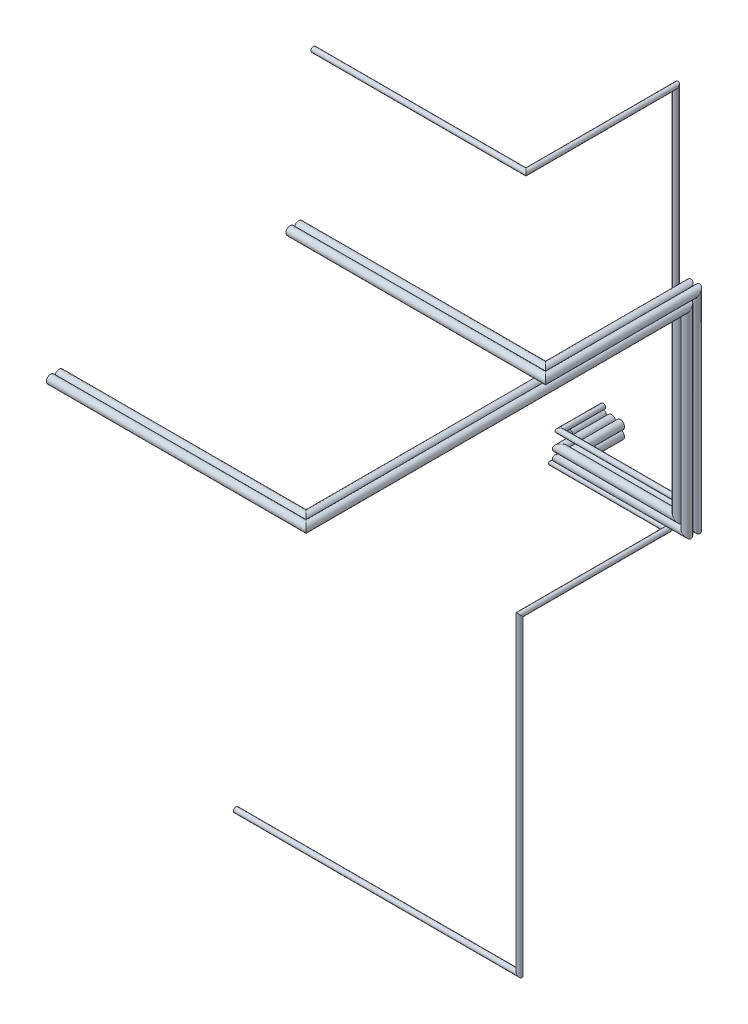
ISO-10303-21;
HEADER;
FILE_DESCRIPTION(('STEP AP214'),'2;1');
FILE_NAME('part.step','',(''),(''),'','','');
FILE_SCHEMA(('AUTOMOTIVE_DESIGN { 1 0 10303 214 1 1 1 1 }'));
ENDSEC;
DATA;
#1=APPLICATION_CONTEXT('core data for automotive mechanical design processes');
#2=APPLICATION_PROTOCOL_DEFINITION('international standard','automotive_design',2000,#1);
#3=PRODUCT_CONTEXT('',#1,'mechanical');
#4=PRODUCT('Part','Part','',(#3));
#5=PRODUCT_RELATED_PRODUCT_CATEGORY('part','',(#4));
#6=PRODUCT_DEFINITION_FORMATION('','',#4);
#7=PRODUCT_DEFINITION_CONTEXT('part definition',#1,'design');
#8=PRODUCT_DEFINITION('design','',#6,#7);
#9=PRODUCT_DEFINITION_SHAPE('','',#8);
#10=(LENGTH_UNIT() NAMED_UNIT(*) SI_UNIT(.MILLI.,.METRE.));
#11=(NAMED_UNIT(*) PLANE_ANGLE_UNIT() SI_UNIT($,.RADIAN.));
#12=(NAMED_UNIT(*) SI_UNIT($,.STERADIAN.) SOLID_ANGLE_UNIT());
#13=UNCERTAINTY_MEASURE_WITH_UNIT(LENGTH_MEASURE(1.E-05),#10,'distance_accuracy_value','');
#14=(GEOMETRIC_REPRESENTATION_CONTEXT(3) GLOBAL_UNCERTAINTY_ASSIGNED_CONTEXT((#13)) GLOBAL_UNIT_ASSIGNED_CONTEXT((#10,
#11,#12)) REPRESENTATION_CONTEXT('',''));
#15=CARTESIAN_POINT('',(0.,0.,0.));
#16=DIRECTION('',(0.,0.,1.));
#17=DIRECTION('',(1.,0.,0.));
#18=AXIS2_PLACEMENT_3D('',#15,#16,#17);
#19=CARTESIAN_POINT('',(-99.2922099597104,-103.996357315317,400.));
#20=DIRECTION('',(0.,0.,-1.));
#21=DIRECTION('',(-1.,0.,0.));
#22=AXIS2_PLACEMENT_3D('',#19,#20,#21);
#23=CYLINDRICAL_SURFACE('',#22,30.);
#24=CARTESIAN_POINT('',(-99.2922099597104,-103.996357315317,0.));
#25=DIRECTION('',(0.,0.,-1.));
#26=DIRECTION('',(-1.,0.,0.));
#27=AXIS2_PLACEMENT_3D('',#24,#25,#26);
#28=CIRCLE('',#27,30.);
#29=CARTESIAN_POINT('',(-129.29220995971,-103.996357315317,0.));
#30=VERTEX_POINT('',#29);
#31=EDGE_CURVE('E12',#30,#30,#28,.T.);
#32=ORIENTED_EDGE('',*,*,#31,.F.);
#33=EDGE_LOOP('',(#32));
#34=FACE_BOUND('',#33,.T.);
#35=CARTESIAN_POINT('',(-99.2922099597104,-103.996357315317,587.653269416734));
#36=DIRECTION('',(0.707106781186548,0.,0.707106781186547));
#37=DIRECTION('',(0.707106781186547,0.,-0.707106781186548));
#38=AXIS2_PLACEMENT_3D('',#35,#36,#37);
#39=ELLIPSE('',#38,42.4264068711929,30.);
#40=CARTESIAN_POINT('',(-69.2922099597104,-103.996357315317,557.653269416734));
#41=VERTEX_POINT('',#40);
#42=EDGE_CURVE('E87',#41,#41,#39,.T.);
#43=ORIENTED_EDGE('',*,*,#42,.F.);
#44=EDGE_LOOP('',(#43));
#45=FACE_BOUND('',#44,.T.);
#46=ADVANCED_FACE('F65',(#34,#45),#23,.T.);
#47=CARTESIAN_POINT('',(-99.2922099597104,-103.996357315317,0.));
#48=DIRECTION('',(0.,0.,-1.));
#49=DIRECTION('',(-1.,0.,0.));
#50=AXIS2_PLACEMENT_3D('',#47,#48,#49);
#51=PLANE('',#50);
#52=ORIENTED_EDGE('',*,*,#31,.T.);
#53=EDGE_LOOP('',(#52));
#54=FACE_BOUND('',#53,.T.);
#55=ADVANCED_FACE('F95',(#54),#51,.T.);
#56=CARTESIAN_POINT('',(1250.70779004029,-3775.40455596034,2337.65326941673));
#57=DIRECTION('',(-1.,0.,0.));
#58=DIRECTION('',(0.,0.,1.));
#59=AXIS2_PLACEMENT_3D('',#56,#57,#58);
#60=CYLINDRICAL_SURFACE('',#59,30.);
#61=CARTESIAN_POINT('',(1250.70779004029,-3775.40455596034,2337.65326941673));
#62=DIRECTION('',(-0.707106781186547,-0.707106781186548,0.));
#63=DIRECTION('',(0.707106781186548,-0.707106781186547,0.));
#64=AXIS2_PLACEMENT_3D('',#61,#62,#63);
#65=ELLIPSE('',#64,42.4264068711929,30.);
#66=CARTESIAN_POINT('',(1280.70779004029,-3805.40455596034,2337.65326941673));
#67=VERTEX_POINT('',#66);
#68=EDGE_CURVE('E75',#67,#67,#65,.F.);
#69=ORIENTED_EDGE('',*,*,#68,.F.);
#70=EDGE_LOOP('',(#69));
#71=FACE_BOUND('',#70,.T.);
#72=CARTESIAN_POINT('',(-2100.96796055242,-3775.40455596034,2337.65326941673));
#73=DIRECTION('',(-1.,0.,0.));
#74=DIRECTION('',(0.,0.,1.));
#75=AXIS2_PLACEMENT_3D('',#72,#73,#74);
#76=CIRCLE('',#75,30.);
#77=CARTESIAN_POINT('',(-2100.96796055242,-3775.40455596034,2367.65326941673));
#78=VERTEX_POINT('',#77);
#79=EDGE_CURVE('E71',#78,#78,#76,.T.);
#80=ORIENTED_EDGE('',*,*,#79,.F.);
#81=EDGE_LOOP('',(#80));
#82=FACE_BOUND('',#81,.T.);
#83=ADVANCED_FACE('F100',(#71,#82),#60,.T.);
#84=CARTESIAN_POINT('',(1250.70779004029,-103.996357315317,2337.65326941673));
#85=DIRECTION('',(0.,-1.,0.));
#86=DIRECTION('',(0.,0.,-1.));
#87=AXIS2_PLACEMENT_3D('',#84,#85,#86);
#88=CYLINDRICAL_SURFACE('',#87,30.);
#89=CARTESIAN_POINT('',(1250.70779004029,-103.996357315317,2337.65326941673));
#90=DIRECTION('',(0.,-0.707106781186548,0.707106781186547));
#91=DIRECTION('',(0.,0.707106781186547,0.707106781186548));
#92=AXIS2_PLACEMENT_3D('',#89,#90,#91);
#93=ELLIPSE('',#92,42.4264068711929,30.);
#94=CARTESIAN_POINT('',(1250.70779004029,-73.9963573153173,2367.65326941673));
#95=VERTEX_POINT('',#94);
#96=EDGE_CURVE('E79',#95,#95,#93,.T.);
#97=ORIENTED_EDGE('',*,*,#96,.T.);
#98=EDGE_LOOP('',(#97));
#99=FACE_BOUND('',#98,.T.);
#100=ORIENTED_EDGE('',*,*,#68,.T.);
#101=EDGE_LOOP('',(#100));
#102=FACE_BOUND('',#101,.T.);
#103=ADVANCED_FACE('F104',(#99,#102),#88,.T.);
#104=CARTESIAN_POINT('',(1250.70779004029,-103.996357315317,587.653269416733));
#105=DIRECTION('',(0.,0.,1.));
#106=DIRECTION('',(1.,0.,0.));
#107=AXIS2_PLACEMENT_3D('',#104,#105,#106);
#108=CYLINDRICAL_SURFACE('',#107,30.);
#109=CARTESIAN_POINT('',(1250.70779004029,-103.996357315317,587.653269416733));
#110=DIRECTION('',(0.707106781186548,0.,0.707106781186548));
#111=DIRECTION('',(0.707106781186548,0.,-0.707106781186548));
#112=AXIS2_PLACEMENT_3D('',#109,#110,#111);
#113=ELLIPSE('',#112,42.4264068711929,30.);
#114=CARTESIAN_POINT('',(1280.70779004029,-103.996357315317,557.653269416733));
#115=VERTEX_POINT('',#114);
#116=EDGE_CURVE('E84',#115,#115,#113,.F.);
#117=ORIENTED_EDGE('',*,*,#116,.F.);
#118=EDGE_LOOP('',(#117));
#119=FACE_BOUND('',#118,.T.);
#120=ORIENTED_EDGE('',*,*,#96,.F.);
#121=EDGE_LOOP('',(#120));
#122=FACE_BOUND('',#121,.T.);
#123=ADVANCED_FACE('F110',(#119,#122),#108,.T.);
#124=CARTESIAN_POINT('',(-99.2922099597104,-103.996357315317,587.653269416734));
#125=DIRECTION('',(1.,0.,0.));
#126=DIRECTION('',(0.,0.,-1.));
#127=AXIS2_PLACEMENT_3D('',#124,#125,#126);
#128=CYLINDRICAL_SURFACE('',#127,30.);
#129=ORIENTED_EDGE('',*,*,#42,.T.);
#130=EDGE_LOOP('',(#129));
#131=FACE_BOUND('',#130,.T.);
#132=ORIENTED_EDGE('',*,*,#116,.T.);
#133=EDGE_LOOP('',(#132));
#134=FACE_BOUND('',#133,.T.);
#135=ADVANCED_FACE('F91',(#131,#134),#128,.T.);
#136=CARTESIAN_POINT('',(-2100.96796055242,-3775.40455596034,2337.65326941673));
#137=DIRECTION('',(-1.,0.,0.));
#138=DIRECTION('',(0.,0.,1.));
#139=AXIS2_PLACEMENT_3D('',#136,#137,#138);
#140=PLANE('',#139);
#141=ORIENTED_EDGE('',*,*,#79,.T.);
#142=EDGE_LOOP('',(#141));
#143=FACE_BOUND('',#142,.T.);
#144=ADVANCED_FACE('F117',(#143),#140,.T.);
#145=CLOSED_SHELL('',(#46,#55,#83,#103,#123,#135,#144));
#146=MANIFOLD_SOLID_BREP('B2',#145);
#147=CARTESIAN_POINT('',(-99.2922099597104,188.112137483015,400.));
#148=DIRECTION('',(0.,0.,-1.));
#149=DIRECTION('',(-1.,0.,0.));
#150=AXIS2_PLACEMENT_3D('',#147,#148,#149);
#151=CYLINDRICAL_SURFACE('',#150,30.);
#152=CARTESIAN_POINT('',(-99.2922099597104,188.112137483015,0.));
#153=DIRECTION('',(0.,0.,-1.));
#154=DIRECTION('',(-1.,0.,0.));
#155=AXIS2_PLACEMENT_3D('',#152,#153,#154);
#156=CIRCLE('',#155,30.);
#157=CARTESIAN_POINT('',(-129.29220995971,188.112137483015,0.));
#158=VERTEX_POINT('',#157);
#159=EDGE_CURVE('E64',#158,#158,#156,.T.);
#160=ORIENTED_EDGE('',*,*,#159,.F.);
#161=EDGE_LOOP('',(#160));
#162=FACE_BOUND('',#161,.T.);
#163=CARTESIAN_POINT('',(-99.2922099597104,188.112137483015,509.853095789654));
#164=DIRECTION('',(0.707106781186548,0.,0.707106781186548));
#165=DIRECTION('',(0.707106781186548,0.,-0.707106781186548));
#166=AXIS2_PLACEMENT_3D('',#163,#164,#165);
#167=ELLIPSE('',#166,42.4264068711928,30.);
#168=CARTESIAN_POINT('',(-69.2922099597104,188.112137483015,479.853095789654));
#169=VERTEX_POINT('',#168);
#170=EDGE_CURVE('E198',#169,#169,#167,.T.);
#171=ORIENTED_EDGE('',*,*,#170,.F.);
#172=EDGE_LOOP('',(#171));
#173=FACE_BOUND('',#172,.T.);
#174=ADVANCED_FACE('F176',(#162,#173),#151,.T.);
#175=CARTESIAN_POINT('',(-99.2922099597104,188.112137483015,0.));
#176=DIRECTION('',(0.,0.,-1.));
#177=DIRECTION('',(-1.,0.,0.));
#178=AXIS2_PLACEMENT_3D('',#175,#176,#177);
#179=PLANE('',#178);
#180=ORIENTED_EDGE('',*,*,#159,.T.);
#181=EDGE_LOOP('',(#180));
#182=FACE_BOUND('',#181,.T.);
#183=ADVANCED_FACE('F206',(#182),#179,.T.);
#184=CARTESIAN_POINT('',(1269.59169265852,4409.27139401603,2281.01235232267));
#185=DIRECTION('',(-1.,0.,0.));
#186=DIRECTION('',(0.,0.,1.));
#187=AXIS2_PLACEMENT_3D('',#184,#185,#186);
#188=CYLINDRICAL_SURFACE('',#187,30.);
#189=CARTESIAN_POINT('',(1269.59169265852,4409.27139401603,2281.01235232267));
#190=DIRECTION('',(-0.707106781186547,0.,0.707106781186548));
#191=DIRECTION('',(0.707106781186548,0.,0.707106781186547));
#192=AXIS2_PLACEMENT_3D('',#189,#190,#191);
#193=ELLIPSE('',#192,42.4264068711929,30.);
#194=CARTESIAN_POINT('',(1299.59169265852,4409.27139401603,2311.01235232267));
#195=VERTEX_POINT('',#194);
#196=EDGE_CURVE('E186',#195,#195,#193,.F.);
#197=ORIENTED_EDGE('',*,*,#196,.F.);
#198=EDGE_LOOP('',(#197));
#199=FACE_BOUND('',#198,.T.);
#200=CARTESIAN_POINT('',(-1241.56375669105,4409.27139401603,2281.01235232267));
#201=DIRECTION('',(-1.,0.,0.));
#202=DIRECTION('',(0.,0.,1.));
#203=AXIS2_PLACEMENT_3D('',#200,#201,#202);
#204=CIRCLE('',#203,30.);
#205=CARTESIAN_POINT('',(-1241.56375669105,4409.27139401603,2311.01235232267));
#206=VERTEX_POINT('',#205);
#207=EDGE_CURVE('E182',#206,#206,#204,.T.);
#208=ORIENTED_EDGE('',*,*,#207,.F.);
#209=EDGE_LOOP('',(#208));
#210=FACE_BOUND('',#209,.T.);
#211=ADVANCED_FACE('F211',(#199,#210),#188,.T.);
#212=CARTESIAN_POINT('',(1269.59169265852,4409.27139401603,509.853095789654));
#213=DIRECTION('',(0.,0.,1.));
#214=DIRECTION('',(1.,0.,0.));
#215=AXIS2_PLACEMENT_3D('',#212,#213,#214);
#216=CYLINDRICAL_SURFACE('',#215,30.);
#217=CARTESIAN_POINT('',(1269.59169265852,4409.27139401603,509.853095789654));
#218=DIRECTION('',(0.,0.707106781186548,0.707106781186548));
#219=DIRECTION('',(0.,0.707106781186548,-0.707106781186548));
#220=AXIS2_PLACEMENT_3D('',#217,#218,#219);
#221=ELLIPSE('',#220,42.4264068711928,30.);
#222=CARTESIAN_POINT('',(1269.59169265852,4439.27139401603,479.853095789654));
#223=VERTEX_POINT('',#222);
#224=EDGE_CURVE('E190',#223,#223,#221,.T.);
#225=ORIENTED_EDGE('',*,*,#224,.T.);
#226=EDGE_LOOP('',(#225));
#227=FACE_BOUND('',#226,.T.);
#228=ORIENTED_EDGE('',*,*,#196,.T.);
#229=EDGE_LOOP('',(#228));
#230=FACE_BOUND('',#229,.T.);
#231=ADVANCED_FACE('F215',(#227,#230),#216,.T.);
#232=CARTESIAN_POINT('',(1269.59169265852,188.112137483015,509.853095789654));
#233=DIRECTION('',(0.,1.,0.));
#234=DIRECTION('',(-1.,0.,0.));
#235=AXIS2_PLACEMENT_3D('',#232,#233,#234);
#236=CYLINDRICAL_SURFACE('',#235,30.);
#237=CARTESIAN_POINT('',(1269.59169265852,188.112137483015,509.853095789654));
#238=DIRECTION('',(0.707106781186547,0.707106781186548,0.));
#239=DIRECTION('',(0.707106781186548,-0.707106781186547,0.));
#240=AXIS2_PLACEMENT_3D('',#237,#238,#239);
#241=ELLIPSE('',#240,42.4264068711928,30.);
#242=CARTESIAN_POINT('',(1299.59169265852,158.112137483015,509.853095789654));
#243=VERTEX_POINT('',#242);
#244=EDGE_CURVE('E195',#243,#243,#241,.F.);
#245=ORIENTED_EDGE('',*,*,#244,.F.);
#246=EDGE_LOOP('',(#245));
#247=FACE_BOUND('',#246,.T.);
#248=ORIENTED_EDGE('',*,*,#224,.F.);
#249=EDGE_LOOP('',(#248));
#250=FACE_BOUND('',#249,.T.);
#251=ADVANCED_FACE('F221',(#247,#250),#236,.T.);
#252=CARTESIAN_POINT('',(-99.2922099597104,188.112137483015,509.853095789654));
#253=DIRECTION('',(1.,0.,0.));
#254=DIRECTION('',(0.,0.,-1.));
#255=AXIS2_PLACEMENT_3D('',#252,#253,#254);
#256=CYLINDRICAL_SURFACE('',#255,30.);
#257=ORIENTED_EDGE('',*,*,#170,.T.);
#258=EDGE_LOOP('',(#257));
#259=FACE_BOUND('',#258,.T.);
#260=ORIENTED_EDGE('',*,*,#244,.T.);
#261=EDGE_LOOP('',(#260));
#262=FACE_BOUND('',#261,.T.);
#263=ADVANCED_FACE('F202',(#259,#262),#256,.T.);
#264=CARTESIAN_POINT('',(-1241.56375669105,4409.27139401603,2281.01235232267));
#265=DIRECTION('',(-1.,0.,0.));
#266=DIRECTION('',(0.,0.,1.));
#267=AXIS2_PLACEMENT_3D('',#264,#265,#266);
#268=PLANE('',#267);
#269=ORIENTED_EDGE('',*,*,#207,.T.);
#270=EDGE_LOOP('',(#269));
#271=FACE_BOUND('',#270,.T.);
#272=ADVANCED_FACE('F228',(#271),#268,.T.);
#273=CLOSED_SHELL('',(#174,#183,#211,#231,#251,#263,#272));
#274=MANIFOLD_SOLID_BREP('B7',#273);
#275=CARTESIAN_POINT('',(-104.92939809415,105.,400.));
#276=DIRECTION('',(0.,0.,-1.));
#277=DIRECTION('',(-1.,0.,0.));
#278=AXIS2_PLACEMENT_3D('',#275,#276,#277);
#279=CYLINDRICAL_SURFACE('',#278,50.);
#280=CARTESIAN_POINT('',(-104.92939809415,105.,400.));
#281=DIRECTION('',(0.,0.,-1.));
#282=DIRECTION('',(-1.,0.,0.));
#283=AXIS2_PLACEMENT_3D('',#280,#281,#282);
#284=CIRCLE('',#283,50.);
#285=CARTESIAN_POINT('',(-154.92939809415,105.,400.));
#286=VERTEX_POINT('',#285);
#287=EDGE_CURVE('E175',#286,#286,#284,.T.);
#288=ORIENTED_EDGE('',*,*,#287,.T.);
#289=EDGE_LOOP('',(#288));
#290=FACE_BOUND('',#289,.T.);
#291=CARTESIAN_POINT('',(-104.92939809415,105.,0.));
#292=DIRECTION('',(0.,0.,-1.));
#293=DIRECTION('',(-1.,0.,0.));
#294=AXIS2_PLACEMENT_3D('',#291,#292,#293);
#295=CIRCLE('',#294,50.);
#296=CARTESIAN_POINT('',(-154.92939809415,105.,0.));
#297=VERTEX_POINT('',#296);
#298=EDGE_CURVE('E290',#297,#297,#295,.T.);
#299=ORIENTED_EDGE('',*,*,#298,.F.);
#300=EDGE_LOOP('',(#299));
#301=FACE_BOUND('',#300,.T.);
#302=ADVANCED_FACE('F287',(#290,#301),#279,.T.);
#303=CARTESIAN_POINT('',(-104.92939809415,105.,400.));
#304=DIRECTION('',(0.,0.,-1.));
#305=DIRECTION('',(-1.,0.,0.));
#306=AXIS2_PLACEMENT_3D('',#303,#304,#305);
#307=PLANE('',#306);
#308=ORIENTED_EDGE('',*,*,#287,.F.);
#309=EDGE_LOOP('',(#308));
#310=FACE_BOUND('',#309,.T.);
#311=ADVANCED_FACE('F302',(#310),#307,.F.);
#312=CARTESIAN_POINT('',(-104.92939809415,105.,0.));
#313=DIRECTION('',(0.,0.,-1.));
#314=DIRECTION('',(-1.,0.,0.));
#315=AXIS2_PLACEMENT_3D('',#312,#313,#314);
#316=PLANE('',#315);
#317=ORIENTED_EDGE('',*,*,#298,.T.);
#318=EDGE_LOOP('',(#317));
#319=FACE_BOUND('',#318,.T.);
#320=ADVANCED_FACE('F299',(#319),#316,.T.);
#321=CLOSED_SHELL('',(#302,#311,#320));
#322=MANIFOLD_SOLID_BREP('B59',#321);
#323=CARTESIAN_POINT('',(-104.92939809415,0.,400.));
#324=DIRECTION('',(0.,0.,-1.));
#325=DIRECTION('',(-1.,0.,0.));
#326=AXIS2_PLACEMENT_3D('',#323,#324,#325);
#327=CYLINDRICAL_SURFACE('',#326,50.);
#328=CARTESIAN_POINT('',(-104.92939809415,0.,400.));
#329=DIRECTION('',(0.,0.,-1.));
#330=DIRECTION('',(-1.,0.,0.));
#331=AXIS2_PLACEMENT_3D('',#328,#329,#330);
#332=CIRCLE('',#331,50.);
#333=CARTESIAN_POINT('',(-154.92939809415,0.,400.));
#334=VERTEX_POINT('',#333);
#335=EDGE_CURVE('E286',#334,#334,#332,.T.);
#336=ORIENTED_EDGE('',*,*,#335,.T.);
#337=EDGE_LOOP('',(#336));
#338=FACE_BOUND('',#337,.T.);
#339=CARTESIAN_POINT('',(-104.92939809415,0.,0.));
#340=DIRECTION('',(0.,0.,-1.));
#341=DIRECTION('',(-1.,0.,0.));
#342=AXIS2_PLACEMENT_3D('',#339,#340,#341);
#343=CIRCLE('',#342,50.);
#344=CARTESIAN_POINT('',(-154.92939809415,0.,0.));
#345=VERTEX_POINT('',#344);
#346=EDGE_CURVE('E338',#345,#345,#343,.T.);
#347=ORIENTED_EDGE('',*,*,#346,.F.);
#348=EDGE_LOOP('',(#347));
#349=FACE_BOUND('',#348,.T.);
#350=ADVANCED_FACE('F335',(#338,#349),#327,.T.);
#351=CARTESIAN_POINT('',(-104.92939809415,0.,400.));
#352=DIRECTION('',(0.,0.,-1.));
#353=DIRECTION('',(-1.,0.,0.));
#354=AXIS2_PLACEMENT_3D('',#351,#352,#353);
#355=PLANE('',#354);
#356=ORIENTED_EDGE('',*,*,#335,.F.);
#357=EDGE_LOOP('',(#356));
#358=FACE_BOUND('',#357,.T.);
#359=ADVANCED_FACE('F350',(#358),#355,.F.);
#360=CARTESIAN_POINT('',(-104.92939809415,0.,0.));
#361=DIRECTION('',(0.,0.,-1.));
#362=DIRECTION('',(-1.,0.,0.));
#363=AXIS2_PLACEMENT_3D('',#360,#361,#362);
#364=PLANE('',#363);
#365=ORIENTED_EDGE('',*,*,#346,.T.);
#366=EDGE_LOOP('',(#365));
#367=FACE_BOUND('',#366,.T.);
#368=ADVANCED_FACE('F347',(#367),#364,.T.);
#369=CLOSED_SHELL('',(#350,#359,#368));
#370=MANIFOLD_SOLID_BREP('B170',#369);
#371=CARTESIAN_POINT('',(1388.36768599158,2300.,600.));
#372=DIRECTION('',(0.,0.,1.));
#373=DIRECTION('',(1.,0.,0.));
#374=AXIS2_PLACEMENT_3D('',#371,#372,#373);
#375=CYLINDRICAL_SURFACE('',#374,50.);
#376=CARTESIAN_POINT('',(1388.36768599158,2300.,600.));
#377=DIRECTION('',(0.,0.707106781186548,0.707106781186548));
#378=DIRECTION('',(0.,0.707106781186548,-0.707106781186548));
#379=AXIS2_PLACEMENT_3D('',#376,#377,#378);
#380=ELLIPSE('',#379,70.7106781186548,50.);
#381=CARTESIAN_POINT('',(1388.36768599158,2350.,550.));
#382=VERTEX_POINT('',#381);
#383=EDGE_CURVE('E334',#382,#382,#380,.T.);
#384=ORIENTED_EDGE('',*,*,#383,.T.);
#385=EDGE_LOOP('',(#384));
#386=FACE_BOUND('',#385,.T.);
#387=CARTESIAN_POINT('',(1388.36768599158,2300.,4998.36768599158));
#388=DIRECTION('',(-0.707106781186547,0.,0.707106781186548));
#389=DIRECTION('',(-0.707106781186548,0.,-0.707106781186547));
#390=AXIS2_PLACEMENT_3D('',#387,#388,#389);
#391=ELLIPSE('',#390,70.7106781186551,50.0000000000002);
#392=CARTESIAN_POINT('',(1338.36768599158,2300.,4948.36768599158));
#393=VERTEX_POINT('',#392);
#394=EDGE_CURVE('E405',#393,#393,#391,.T.);
#395=ORIENTED_EDGE('',*,*,#394,.F.);
#396=EDGE_LOOP('',(#395));
#397=FACE_BOUND('',#396,.T.);
#398=ADVANCED_FACE('F383',(#386,#397),#375,.T.);
#399=CARTESIAN_POINT('',(1388.36768599158,101.632314008421,600.));
#400=DIRECTION('',(0.,1.,0.));
#401=DIRECTION('',(-1.,0.,0.));
#402=AXIS2_PLACEMENT_3D('',#399,#400,#401);
#403=CYLINDRICAL_SURFACE('',#402,50.);
#404=CARTESIAN_POINT('',(1388.36768599158,101.632314008421,600.));
#405=DIRECTION('',(0.707106781186548,0.707106781186547,0.));
#406=DIRECTION('',(0.707106781186547,-0.707106781186548,0.));
#407=AXIS2_PLACEMENT_3D('',#404,#405,#406);
#408=ELLIPSE('',#407,70.7106781186548,50.);
#409=CARTESIAN_POINT('',(1438.36768599158,51.6323140084215,600.));
#410=VERTEX_POINT('',#409);
#411=EDGE_CURVE('E389',#410,#410,#408,.F.);
#412=ORIENTED_EDGE('',*,*,#411,.F.);
#413=EDGE_LOOP('',(#412));
#414=FACE_BOUND('',#413,.T.);
#415=ORIENTED_EDGE('',*,*,#383,.F.);
#416=EDGE_LOOP('',(#415));
#417=FACE_BOUND('',#416,.T.);
#418=ADVANCED_FACE('F413',(#414,#417),#403,.T.);
#419=CARTESIAN_POINT('',(-3.54847327783849E-13,101.632314008421,600.));
#420=DIRECTION('',(1.,0.,0.));
#421=DIRECTION('',(0.,1.,0.));
#422=AXIS2_PLACEMENT_3D('',#419,#420,#421);
#423=CYLINDRICAL_SURFACE('',#422,50.);
#424=CARTESIAN_POINT('',(-3.54847327783849E-13,101.632314008421,600.));
#425=DIRECTION('',(0.707106781186548,0.,0.707106781186548));
#426=DIRECTION('',(0.707106781186548,0.,-0.707106781186548));
#427=AXIS2_PLACEMENT_3D('',#424,#425,#426);
#428=ELLIPSE('',#427,70.7106781186548,50.);
#429=CARTESIAN_POINT('',(49.9999999999997,101.632314008421,550.));
#430=VERTEX_POINT('',#429);
#431=EDGE_CURVE('E393',#430,#430,#428,.T.);
#432=ORIENTED_EDGE('',*,*,#431,.T.);
#433=EDGE_LOOP('',(#432));
#434=FACE_BOUND('',#433,.T.);
#435=ORIENTED_EDGE('',*,*,#411,.T.);
#436=EDGE_LOOP('',(#435));
#437=FACE_BOUND('',#436,.T.);
#438=ADVANCED_FACE('F417',(#434,#437),#423,.T.);
#439=CARTESIAN_POINT('',(-3.54847327783849E-13,101.632314008421,741.42135623731));
#440=DIRECTION('',(0.,0.,-1.));
#441=DIRECTION('',(0.,1.,0.));
#442=AXIS2_PLACEMENT_3D('',#439,#440,#441);
#443=CYLINDRICAL_SURFACE('',#442,50.);
#444=CARTESIAN_POINT('',(-3.54847327783849E-13,101.632314008422,0.));
#445=DIRECTION('',(0.,0.,1.));
#446=DIRECTION('',(1.,0.,0.));
#447=AXIS2_PLACEMENT_3D('',#444,#445,#446);
#448=CIRCLE('',#447,50.);
#449=CARTESIAN_POINT('',(49.9999999999997,101.632314008422,0.));
#450=VERTEX_POINT('',#449);
#451=EDGE_CURVE('E397',#450,#450,#448,.T.);
#452=ORIENTED_EDGE('',*,*,#451,.T.);
#453=EDGE_LOOP('',(#452));
#454=FACE_BOUND('',#453,.T.);
#455=ORIENTED_EDGE('',*,*,#431,.F.);
#456=EDGE_LOOP('',(#455));
#457=FACE_BOUND('',#456,.T.);
#458=ADVANCED_FACE('F422',(#454,#457),#443,.T.);
#459=CARTESIAN_POINT('',(-3.54847327783849E-13,101.632314008422,0.));
#460=DIRECTION('',(0.,0.,1.));
#461=DIRECTION('',(1.,0.,0.));
#462=AXIS2_PLACEMENT_3D('',#459,#460,#461);
#463=PLANE('',#462);
#464=ORIENTED_EDGE('',*,*,#451,.F.);
#465=EDGE_LOOP('',(#464));
#466=FACE_BOUND('',#465,.T.);
#467=ADVANCED_FACE('F429',(#466),#463,.F.);
#468=CARTESIAN_POINT('',(1388.36768599158,2300.,4998.36768599158));
#469=DIRECTION('',(-1.,0.,0.));
#470=DIRECTION('',(0.,0.,1.));
#471=AXIS2_PLACEMENT_3D('',#468,#469,#470);
#472=CYLINDRICAL_SURFACE('',#471,50.0000000000002);
#473=ORIENTED_EDGE('',*,*,#394,.T.);
#474=EDGE_LOOP('',(#473));
#475=FACE_BOUND('',#474,.T.);
#476=CARTESIAN_POINT('',(-1529.31347082501,2300.,4998.36768599158));
#477=DIRECTION('',(-1.,0.,0.));
#478=DIRECTION('',(0.,0.,1.));
#479=AXIS2_PLACEMENT_3D('',#476,#477,#478);
#480=CIRCLE('',#479,50.0000000000002);
#481=CARTESIAN_POINT('',(-1529.31347082501,2300.,5048.36768599158));
#482=VERTEX_POINT('',#481);
#483=EDGE_CURVE('E402',#482,#482,#480,.F.);
#484=ORIENTED_EDGE('',*,*,#483,.T.);
#485=EDGE_LOOP('',(#484));
#486=FACE_BOUND('',#485,.T.);
#487=ADVANCED_FACE('F409',(#475,#486),#472,.T.);
#488=CARTESIAN_POINT('',(-1529.31347082501,2300.,4998.36768599158));
#489=DIRECTION('',(-1.,0.,0.));
#490=DIRECTION('',(0.,0.,1.));
#491=AXIS2_PLACEMENT_3D('',#488,#489,#490);
#492=PLANE('',#491);
#493=ORIENTED_EDGE('',*,*,#483,.F.);
#494=EDGE_LOOP('',(#493));
#495=FACE_BOUND('',#494,.T.);
#496=ADVANCED_FACE('F436',(#495),#492,.T.);
#497=CLOSED_SHELL('',(#398,#418,#438,#458,#467,#487,#496));
#498=MANIFOLD_SOLID_BREP('B281',#497);
#499=CARTESIAN_POINT('',(1388.36768599158,2404.62025979999,495.379740200007));
#500=DIRECTION('',(0.,0.,1.));
#501=DIRECTION('',(1.,0.,0.));
#502=AXIS2_PLACEMENT_3D('',#499,#500,#501);
#503=CYLINDRICAL_SURFACE('',#502,50.);
#504=CARTESIAN_POINT('',(1388.36768599158,2404.62025979999,495.379740200007));
#505=DIRECTION('',(0.,0.707106781186548,0.707106781186548));
#506=DIRECTION('',(0.,0.707106781186548,-0.707106781186548));
#507=AXIS2_PLACEMENT_3D('',#504,#505,#506);
#508=ELLIPSE('',#507,70.7106781186547,50.);
#509=CARTESIAN_POINT('',(1388.36768599158,2454.62025979999,445.379740200007));
#510=VERTEX_POINT('',#509);
#511=EDGE_CURVE('E382',#510,#510,#508,.T.);
#512=ORIENTED_EDGE('',*,*,#511,.T.);
#513=EDGE_LOOP('',(#512));
#514=FACE_BOUND('',#513,.T.);
#515=CARTESIAN_POINT('',(1388.36768599158,2404.62025979999,2167.68115681659));
#516=DIRECTION('',(-0.707106781186548,0.,0.707106781186548));
#517=DIRECTION('',(-0.707106781186548,0.,-0.707106781186548));
#518=AXIS2_PLACEMENT_3D('',#515,#516,#517);
#519=ELLIPSE('',#518,70.7106781186545,49.9999999999998);
#520=CARTESIAN_POINT('',(1338.36768599158,2404.62025979999,2117.68115681659));
#521=VERTEX_POINT('',#520);
#522=EDGE_CURVE('E518',#521,#521,#519,.T.);
#523=ORIENTED_EDGE('',*,*,#522,.F.);
#524=EDGE_LOOP('',(#523));
#525=FACE_BOUND('',#524,.T.);
#526=ADVANCED_FACE('F496',(#514,#525),#503,.T.);
#527=CARTESIAN_POINT('',(1388.36768599158,101.632314008422,495.379740200007));
#528=DIRECTION('',(0.,1.,0.));
#529=DIRECTION('',(-1.,0.,0.));
#530=AXIS2_PLACEMENT_3D('',#527,#528,#529);
#531=CYLINDRICAL_SURFACE('',#530,50.);
#532=CARTESIAN_POINT('',(1388.36768599158,101.632314008422,495.379740200007));
#533=DIRECTION('',(0.707106781186548,0.707106781186547,0.));
#534=DIRECTION('',(0.707106781186547,-0.707106781186548,0.));
#535=AXIS2_PLACEMENT_3D('',#532,#533,#534);
#536=ELLIPSE('',#535,70.7106781186547,50.);
#537=CARTESIAN_POINT('',(1438.36768599158,51.6323140084215,495.379740200007));
#538=VERTEX_POINT('',#537);
#539=EDGE_CURVE('E502',#538,#538,#536,.F.);
#540=ORIENTED_EDGE('',*,*,#539,.F.);
#541=EDGE_LOOP('',(#540));
#542=FACE_BOUND('',#541,.T.);
#543=ORIENTED_EDGE('',*,*,#511,.F.);
#544=EDGE_LOOP('',(#543));
#545=FACE_BOUND('',#544,.T.);
#546=ADVANCED_FACE('F526',(#542,#545),#531,.T.);
#547=CARTESIAN_POINT('',(104.620259799993,101.632314008422,495.379740200007));
#548=DIRECTION('',(1.,0.,0.));
#549=DIRECTION('',(0.,1.,0.));
#550=AXIS2_PLACEMENT_3D('',#547,#548,#549);
#551=CYLINDRICAL_SURFACE('',#550,50.);
#552=CARTESIAN_POINT('',(104.620259799993,101.632314008422,495.379740200007));
#553=DIRECTION('',(0.707106781186548,0.,0.707106781186548));
#554=DIRECTION('',(0.707106781186548,0.,-0.707106781186548));
#555=AXIS2_PLACEMENT_3D('',#552,#553,#554);
#556=ELLIPSE('',#555,70.7106781186547,50.);
#557=CARTESIAN_POINT('',(154.620259799993,101.632314008422,445.379740200007));
#558=VERTEX_POINT('',#557);
#559=EDGE_CURVE('E506',#558,#558,#556,.T.);
#560=ORIENTED_EDGE('',*,*,#559,.T.);
#561=EDGE_LOOP('',(#560));
#562=FACE_BOUND('',#561,.T.);
#563=ORIENTED_EDGE('',*,*,#539,.T.);
#564=EDGE_LOOP('',(#563));
#565=FACE_BOUND('',#564,.T.);
#566=ADVANCED_FACE('F530',(#562,#565),#551,.T.);
#567=CARTESIAN_POINT('',(104.620259799993,101.632314008421,636.801096437317));
#568=DIRECTION('',(0.,0.,-1.));
#569=DIRECTION('',(0.,1.,0.));
#570=AXIS2_PLACEMENT_3D('',#567,#568,#569);
#571=CYLINDRICAL_SURFACE('',#570,50.);
#572=CARTESIAN_POINT('',(104.620259799993,101.632314008422,0.));
#573=DIRECTION('',(0.,0.,1.));
#574=DIRECTION('',(1.,0.,0.));
#575=AXIS2_PLACEMENT_3D('',#572,#573,#574);
#576=CIRCLE('',#575,50.);
#577=CARTESIAN_POINT('',(154.620259799993,101.632314008422,0.));
#578=VERTEX_POINT('',#577);
#579=EDGE_CURVE('E510',#578,#578,#576,.T.);
#580=ORIENTED_EDGE('',*,*,#579,.T.);
#581=EDGE_LOOP('',(#580));
#582=FACE_BOUND('',#581,.T.);
#583=ORIENTED_EDGE('',*,*,#559,.F.);
#584=EDGE_LOOP('',(#583));
#585=FACE_BOUND('',#584,.T.);
#586=ADVANCED_FACE('F535',(#582,#585),#571,.T.);
#587=CARTESIAN_POINT('',(104.620259799993,101.632314008422,0.));
#588=DIRECTION('',(0.,0.,1.));
#589=DIRECTION('',(1.,0.,0.));
#590=AXIS2_PLACEMENT_3D('',#587,#588,#589);
#591=PLANE('',#590);
#592=ORIENTED_EDGE('',*,*,#579,.F.);
#593=EDGE_LOOP('',(#592));
#594=FACE_BOUND('',#593,.T.);
#595=ADVANCED_FACE('F542',(#594),#591,.F.);
#596=CARTESIAN_POINT('',(1388.36768599158,2404.62025979999,2167.68115681659));
#597=DIRECTION('',(-1.,0.,0.));
#598=DIRECTION('',(0.,0.,1.));
#599=AXIS2_PLACEMENT_3D('',#596,#597,#598);
#600=CYLINDRICAL_SURFACE('',#599,49.9999999999998);
#601=ORIENTED_EDGE('',*,*,#522,.T.);
#602=EDGE_LOOP('',(#601));
#603=FACE_BOUND('',#602,.T.);
#604=CARTESIAN_POINT('',(-1529.31347082501,2404.62025979999,2167.68115681659));
#605=DIRECTION('',(-1.,0.,0.));
#606=DIRECTION('',(0.,0.,1.));
#607=AXIS2_PLACEMENT_3D('',#604,#605,#606);
#608=CIRCLE('',#607,49.9999999999998);
#609=CARTESIAN_POINT('',(-1529.31347082501,2404.62025979999,2217.68115681659));
#610=VERTEX_POINT('',#609);
#611=EDGE_CURVE('E515',#610,#610,#608,.F.);
#612=ORIENTED_EDGE('',*,*,#611,.T.);
#613=EDGE_LOOP('',(#612));
#614=FACE_BOUND('',#613,.T.);
#615=ADVANCED_FACE('F522',(#603,#614),#600,.T.);
#616=CARTESIAN_POINT('',(-1529.31347082501,2404.62025979999,2167.68115681659));
#617=DIRECTION('',(-1.,0.,0.));
#618=DIRECTION('',(0.,0.,1.));
#619=AXIS2_PLACEMENT_3D('',#616,#617,#618);
#620=PLANE('',#619);
#621=ORIENTED_EDGE('',*,*,#611,.F.);
#622=EDGE_LOOP('',(#621));
#623=FACE_BOUND('',#622,.T.);
#624=ADVANCED_FACE('F549',(#623),#620,.T.);
#625=CLOSED_SHELL('',(#526,#546,#566,#586,#595,#615,#624));
#626=MANIFOLD_SOLID_BREP('B329',#625);
#627=CARTESIAN_POINT('',(1490.,2300.,600.));
#628=DIRECTION('',(0.,0.,1.));
#629=DIRECTION('',(1.,0.,0.));
#630=AXIS2_PLACEMENT_3D('',#627,#628,#629);
#631=CYLINDRICAL_SURFACE('',#630,50.);
#632=CARTESIAN_POINT('',(1490.,2300.,600.));
#633=DIRECTION('',(0.,0.707106781186548,0.707106781186548));
#634=DIRECTION('',(0.,0.707106781186548,-0.707106781186548));
#635=AXIS2_PLACEMENT_3D('',#632,#633,#634);
#636=ELLIPSE('',#635,70.7106781186548,50.);
#637=CARTESIAN_POINT('',(1490.,2350.,550.));
#638=VERTEX_POINT('',#637);
#639=EDGE_CURVE('E495',#638,#638,#636,.T.);
#640=ORIENTED_EDGE('',*,*,#639,.T.);
#641=EDGE_LOOP('',(#640));
#642=FACE_BOUND('',#641,.T.);
#643=CARTESIAN_POINT('',(1490.,2300.,5100.));
#644=DIRECTION('',(-0.707106781186547,0.,0.707106781186548));
#645=DIRECTION('',(-0.707106781186548,0.,-0.707106781186547));
#646=AXIS2_PLACEMENT_3D('',#643,#644,#645);
#647=ELLIPSE('',#646,70.7106781186548,50.);
#648=CARTESIAN_POINT('',(1440.,2300.,5050.));
#649=VERTEX_POINT('',#648);
#650=EDGE_CURVE('E630',#649,#649,#647,.T.);
#651=ORIENTED_EDGE('',*,*,#650,.F.);
#652=EDGE_LOOP('',(#651));
#653=FACE_BOUND('',#652,.T.);
#654=ADVANCED_FACE('F608',(#642,#653),#631,.T.);
#655=CARTESIAN_POINT('',(1490.,0.,600.));
#656=DIRECTION('',(0.,1.,0.));
#657=DIRECTION('',(-1.,0.,0.));
#658=AXIS2_PLACEMENT_3D('',#655,#656,#657);
#659=CYLINDRICAL_SURFACE('',#658,50.);
#660=CARTESIAN_POINT('',(1490.,0.,600.));
#661=DIRECTION('',(0.707106781186548,0.707106781186547,0.));
#662=DIRECTION('',(0.707106781186547,-0.707106781186548,0.));
#663=AXIS2_PLACEMENT_3D('',#660,#661,#662);
#664=ELLIPSE('',#663,70.7106781186548,50.);
#665=CARTESIAN_POINT('',(1540.,-50.0000000000001,600.));
#666=VERTEX_POINT('',#665);
#667=EDGE_CURVE('E614',#666,#666,#664,.F.);
#668=ORIENTED_EDGE('',*,*,#667,.F.);
#669=EDGE_LOOP('',(#668));
#670=FACE_BOUND('',#669,.T.);
#671=ORIENTED_EDGE('',*,*,#639,.F.);
#672=EDGE_LOOP('',(#671));
#673=FACE_BOUND('',#672,.T.);
#674=ADVANCED_FACE('F638',(#670,#673),#659,.T.);
#675=CARTESIAN_POINT('',(0.,0.,600.));
#676=DIRECTION('',(1.,0.,0.));
#677=DIRECTION('',(0.,1.,0.));
#678=AXIS2_PLACEMENT_3D('',#675,#676,#677);
#679=CYLINDRICAL_SURFACE('',#678,50.);
#680=CARTESIAN_POINT('',(0.,0.,600.));
#681=DIRECTION('',(0.707106781186548,0.,0.707106781186548));
#682=DIRECTION('',(0.707106781186548,0.,-0.707106781186548));
#683=AXIS2_PLACEMENT_3D('',#680,#681,#682);
#684=ELLIPSE('',#683,70.7106781186548,50.);
#685=CARTESIAN_POINT('',(50.,0.,550.));
#686=VERTEX_POINT('',#685);
#687=EDGE_CURVE('E618',#686,#686,#684,.T.);
#688=ORIENTED_EDGE('',*,*,#687,.T.);
#689=EDGE_LOOP('',(#688));
#690=FACE_BOUND('',#689,.T.);
#691=ORIENTED_EDGE('',*,*,#667,.T.);
#692=EDGE_LOOP('',(#691));
#693=FACE_BOUND('',#692,.T.);
#694=ADVANCED_FACE('F642',(#690,#693),#679,.T.);
#695=CARTESIAN_POINT('',(0.,0.,741.42135623731));
#696=DIRECTION('',(0.,0.,-1.));
#697=DIRECTION('',(0.,1.,0.));
#698=AXIS2_PLACEMENT_3D('',#695,#696,#697);
#699=CYLINDRICAL_SURFACE('',#698,50.);
#700=CARTESIAN_POINT('',(0.,0.,0.));
#701=DIRECTION('',(0.,0.,1.));
#702=DIRECTION('',(1.,0.,0.));
#703=AXIS2_PLACEMENT_3D('',#700,#701,#702);
#704=CIRCLE('',#703,50.);
#705=CARTESIAN_POINT('',(50.,0.,0.));
#706=VERTEX_POINT('',#705);
#707=EDGE_CURVE('E622',#706,#706,#704,.T.);
#708=ORIENTED_EDGE('',*,*,#707,.T.);
#709=EDGE_LOOP('',(#708));
#710=FACE_BOUND('',#709,.T.);
#711=ORIENTED_EDGE('',*,*,#687,.F.);
#712=EDGE_LOOP('',(#711));
#713=FACE_BOUND('',#712,.T.);
#714=ADVANCED_FACE('F647',(#710,#713),#699,.T.);
#715=CARTESIAN_POINT('',(0.,0.,0.));
#716=DIRECTION('',(0.,0.,1.));
#717=DIRECTION('',(1.,0.,0.));
#718=AXIS2_PLACEMENT_3D('',#715,#716,#717);
#719=PLANE('',#718);
#720=ORIENTED_EDGE('',*,*,#707,.F.);
#721=EDGE_LOOP('',(#720));
#722=FACE_BOUND('',#721,.T.);
#723=ADVANCED_FACE('F654',(#722),#719,.F.);
#724=CARTESIAN_POINT('',(1490.,2300.,5100.));
#725=DIRECTION('',(-1.,0.,0.));
#726=DIRECTION('',(0.,0.,1.));
#727=AXIS2_PLACEMENT_3D('',#724,#725,#726);
#728=CYLINDRICAL_SURFACE('',#727,50.);
#729=ORIENTED_EDGE('',*,*,#650,.T.);
#730=EDGE_LOOP('',(#729));
#731=FACE_BOUND('',#730,.T.);
#732=CARTESIAN_POINT('',(-1529.31347082501,2300.,5100.));
#733=DIRECTION('',(-1.,0.,0.));
#734=DIRECTION('',(0.,0.,1.));
#735=AXIS2_PLACEMENT_3D('',#732,#733,#734);
#736=CIRCLE('',#735,50.);
#737=CARTESIAN_POINT('',(-1529.31347082501,2300.,5150.));
#738=VERTEX_POINT('',#737);
#739=EDGE_CURVE('E627',#738,#738,#736,.F.);
#740=ORIENTED_EDGE('',*,*,#739,.T.);
#741=EDGE_LOOP('',(#740));
#742=FACE_BOUND('',#741,.T.);
#743=ADVANCED_FACE('F634',(#731,#742),#728,.T.);
#744=CARTESIAN_POINT('',(-1529.31347082501,2300.,5100.));
#745=DIRECTION('',(-1.,0.,0.));
#746=DIRECTION('',(0.,0.,1.));
#747=AXIS2_PLACEMENT_3D('',#744,#745,#746);
#748=PLANE('',#747);
#749=ORIENTED_EDGE('',*,*,#739,.F.);
#750=EDGE_LOOP('',(#749));
#751=FACE_BOUND('',#750,.T.);
#752=ADVANCED_FACE('F661',(#751),#748,.T.);
#753=CLOSED_SHELL('',(#654,#674,#694,#714,#723,#743,#752));
#754=MANIFOLD_SOLID_BREP('B377',#753);
#755=CARTESIAN_POINT('',(1490.,2404.62025979999,495.379740200007));
#756=DIRECTION('',(0.,0.,1.));
#757=DIRECTION('',(1.,0.,0.));
#758=AXIS2_PLACEMENT_3D('',#755,#756,#757);
#759=CYLINDRICAL_SURFACE('',#758,50.);
#760=CARTESIAN_POINT('',(1490.,2404.62025979999,495.379740200007));
#761=DIRECTION('',(0.,0.707106781186548,0.707106781186548));
#762=DIRECTION('',(0.,0.707106781186548,-0.707106781186548));
#763=AXIS2_PLACEMENT_3D('',#760,#761,#762);
#764=ELLIPSE('',#763,70.7106781186548,50.);
#765=CARTESIAN_POINT('',(1490.,2454.62025979999,445.379740200007));
#766=VERTEX_POINT('',#765);
#767=EDGE_CURVE('E607',#766,#766,#764,.T.);
#768=ORIENTED_EDGE('',*,*,#767,.T.);
#769=EDGE_LOOP('',(#768));
#770=FACE_BOUND('',#769,.T.);
#771=CARTESIAN_POINT('',(1490.,2404.62025979999,2269.31347082501));
#772=DIRECTION('',(-0.707106781186548,0.,0.707106781186548));
#773=DIRECTION('',(-0.707106781186548,0.,-0.707106781186548));
#774=AXIS2_PLACEMENT_3D('',#771,#772,#773);
#775=ELLIPSE('',#774,70.7106781186548,50.);
#776=CARTESIAN_POINT('',(1440.,2404.62025979999,2219.31347082501));
#777=VERTEX_POINT('',#776);
#778=EDGE_CURVE('E735',#777,#777,#775,.T.);
#779=ORIENTED_EDGE('',*,*,#778,.F.);
#780=EDGE_LOOP('',(#779));
#781=FACE_BOUND('',#780,.T.);
#782=ADVANCED_FACE('F713',(#770,#781),#759,.T.);
#783=CARTESIAN_POINT('',(1490.,0.,495.379740200007));
#784=DIRECTION('',(0.,1.,0.));
#785=DIRECTION('',(-1.,0.,0.));
#786=AXIS2_PLACEMENT_3D('',#783,#784,#785);
#787=CYLINDRICAL_SURFACE('',#786,50.);
#788=CARTESIAN_POINT('',(1490.,0.,495.379740200007));
#789=DIRECTION('',(0.707106781186548,0.707106781186547,0.));
#790=DIRECTION('',(0.707106781186547,-0.707106781186548,0.));
#791=AXIS2_PLACEMENT_3D('',#788,#789,#790);
#792=ELLIPSE('',#791,70.7106781186548,50.);
#793=CARTESIAN_POINT('',(1540.,-50.0000000000001,495.379740200007));
#794=VERTEX_POINT('',#793);
#795=EDGE_CURVE('E719',#794,#794,#792,.F.);
#796=ORIENTED_EDGE('',*,*,#795,.F.);
#797=EDGE_LOOP('',(#796));
#798=FACE_BOUND('',#797,.T.);
#799=ORIENTED_EDGE('',*,*,#767,.F.);
#800=EDGE_LOOP('',(#799));
#801=FACE_BOUND('',#800,.T.);
#802=ADVANCED_FACE('F743',(#798,#801),#787,.T.);
#803=CARTESIAN_POINT('',(104.620259799993,0.,495.379740200007));
#804=DIRECTION('',(1.,0.,0.));
#805=DIRECTION('',(0.,1.,0.));
#806=AXIS2_PLACEMENT_3D('',#803,#804,#805);
#807=CYLINDRICAL_SURFACE('',#806,50.);
#808=CARTESIAN_POINT('',(104.620259799993,0.,495.379740200007));
#809=DIRECTION('',(0.707106781186548,0.,0.707106781186548));
#810=DIRECTION('',(0.707106781186548,0.,-0.707106781186548));
#811=AXIS2_PLACEMENT_3D('',#808,#809,#810);
#812=ELLIPSE('',#811,70.7106781186548,50.);
#813=CARTESIAN_POINT('',(154.620259799993,0.,445.379740200007));
#814=VERTEX_POINT('',#813);
#815=EDGE_CURVE('E723',#814,#814,#812,.T.);
#816=ORIENTED_EDGE('',*,*,#815,.T.);
#817=EDGE_LOOP('',(#816));
#818=FACE_BOUND('',#817,.T.);
#819=ORIENTED_EDGE('',*,*,#795,.T.);
#820=EDGE_LOOP('',(#819));
#821=FACE_BOUND('',#820,.T.);
#822=ADVANCED_FACE('F747',(#818,#821),#807,.T.);
#823=CARTESIAN_POINT('',(104.620259799993,0.,636.801096437317));
#824=DIRECTION('',(0.,0.,-1.));
#825=DIRECTION('',(0.,1.,0.));
#826=AXIS2_PLACEMENT_3D('',#823,#824,#825);
#827=CYLINDRICAL_SURFACE('',#826,50.);
#828=CARTESIAN_POINT('',(104.620259799993,0.,0.));
#829=DIRECTION('',(0.,0.,1.));
#830=DIRECTION('',(1.,0.,0.));
#831=AXIS2_PLACEMENT_3D('',#828,#829,#830);
#832=CIRCLE('',#831,50.);
#833=CARTESIAN_POINT('',(154.620259799993,0.,0.));
#834=VERTEX_POINT('',#833);
#835=EDGE_CURVE('E727',#834,#834,#832,.T.);
#836=ORIENTED_EDGE('',*,*,#835,.T.);
#837=EDGE_LOOP('',(#836));
#838=FACE_BOUND('',#837,.T.);
#839=ORIENTED_EDGE('',*,*,#815,.F.);
#840=EDGE_LOOP('',(#839));
#841=FACE_BOUND('',#840,.T.);
#842=ADVANCED_FACE('F752',(#838,#841),#827,.T.);
#843=CARTESIAN_POINT('',(104.620259799993,0.,0.));
#844=DIRECTION('',(0.,0.,1.));
#845=DIRECTION('',(1.,0.,0.));
#846=AXIS2_PLACEMENT_3D('',#843,#844,#845);
#847=PLANE('',#846);
#848=ORIENTED_EDGE('',*,*,#835,.F.);
#849=EDGE_LOOP('',(#848));
#850=FACE_BOUND('',#849,.T.);
#851=ADVANCED_FACE('F759',(#850),#847,.F.);
#852=CARTESIAN_POINT('',(1490.,2404.62025979999,2269.31347082501));
#853=DIRECTION('',(-1.,0.,0.));
#854=DIRECTION('',(0.,0.,1.));
#855=AXIS2_PLACEMENT_3D('',#852,#853,#854);
#856=CYLINDRICAL_SURFACE('',#855,50.);
#857=ORIENTED_EDGE('',*,*,#778,.T.);
#858=EDGE_LOOP('',(#857));
#859=FACE_BOUND('',#858,.T.);
#860=CARTESIAN_POINT('',(-1529.31347082501,2404.62025979999,2269.31347082501));
#861=DIRECTION('',(-1.,0.,0.));
#862=DIRECTION('',(0.,0.,1.));
#863=AXIS2_PLACEMENT_3D('',#860,#861,#862);
#864=CIRCLE('',#863,50.);
#865=CARTESIAN_POINT('',(-1529.31347082501,2404.62025979999,2319.31347082501));
#866=VERTEX_POINT('',#865);
#867=EDGE_CURVE('E732',#866,#866,#864,.F.);
#868=ORIENTED_EDGE('',*,*,#867,.T.);
#869=EDGE_LOOP('',(#868));
#870=FACE_BOUND('',#869,.T.);
#871=ADVANCED_FACE('F739',(#859,#870),#856,.T.);
#872=CARTESIAN_POINT('',(-1529.31347082501,2404.62025979999,2269.31347082501));
#873=DIRECTION('',(-1.,0.,0.));
#874=DIRECTION('',(0.,0.,1.));
#875=AXIS2_PLACEMENT_3D('',#872,#873,#874);
#876=PLANE('',#875);
#877=ORIENTED_EDGE('',*,*,#867,.F.);
#878=EDGE_LOOP('',(#877));
#879=FACE_BOUND('',#878,.T.);
#880=ADVANCED_FACE('F766',(#879),#876,.T.);
#881=CLOSED_SHELL('',(#782,#802,#822,#842,#851,#871,#880));
#882=MANIFOLD_SOLID_BREP('B490',#881);
#883=ADVANCED_BREP_SHAPE_REPRESENTATION('',(#18,#146,#274,#322,#370,#498,#626,#754,#882),#14);
#884=SHAPE_DEFINITION_REPRESENTATION(#9,#883);
ENDSEC;
END-ISO-10303-21;
